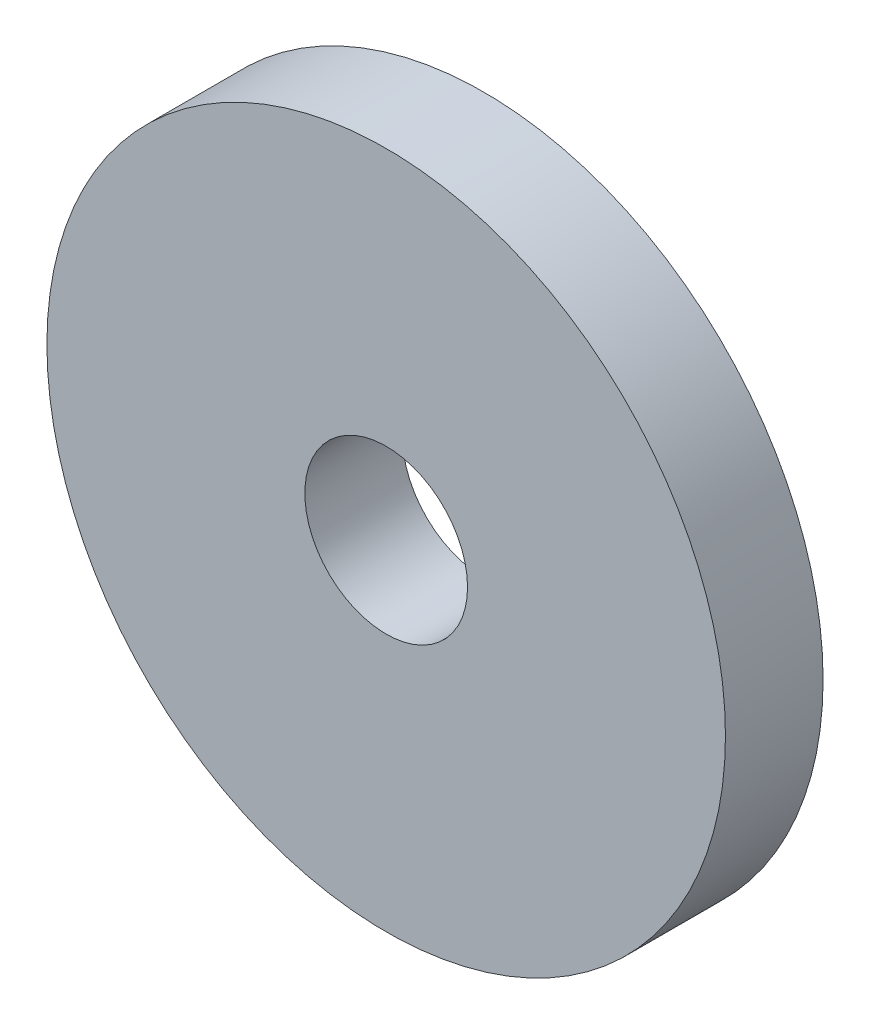
ISO-10303-21;
HEADER;
FILE_DESCRIPTION(('STEP AP214'),'2;1');
FILE_NAME('part.step','',(''),(''),'','','');
FILE_SCHEMA(('AUTOMOTIVE_DESIGN { 1 0 10303 214 1 1 1 1 }'));
ENDSEC;
DATA;
#1=APPLICATION_CONTEXT('core data for automotive mechanical design processes');
#2=APPLICATION_PROTOCOL_DEFINITION('international standard','automotive_design',2000,#1);
#3=PRODUCT_CONTEXT('',#1,'mechanical');
#4=PRODUCT('Part','Part','',(#3));
#5=PRODUCT_RELATED_PRODUCT_CATEGORY('part','',(#4));
#6=PRODUCT_DEFINITION_FORMATION('','',#4);
#7=PRODUCT_DEFINITION_CONTEXT('part definition',#1,'design');
#8=PRODUCT_DEFINITION('design','',#6,#7);
#9=PRODUCT_DEFINITION_SHAPE('','',#8);
#10=(LENGTH_UNIT() NAMED_UNIT(*) SI_UNIT(.MILLI.,.METRE.));
#11=(NAMED_UNIT(*) PLANE_ANGLE_UNIT() SI_UNIT($,.RADIAN.));
#12=(NAMED_UNIT(*) SI_UNIT($,.STERADIAN.) SOLID_ANGLE_UNIT());
#13=UNCERTAINTY_MEASURE_WITH_UNIT(LENGTH_MEASURE(1.E-05),#10,'distance_accuracy_value','');
#14=(GEOMETRIC_REPRESENTATION_CONTEXT(3) GLOBAL_UNCERTAINTY_ASSIGNED_CONTEXT((#13)) GLOBAL_UNIT_ASSIGNED_CONTEXT((#10,
#11,#12)) REPRESENTATION_CONTEXT('',''));
#15=CARTESIAN_POINT('',(0.,0.,0.));
#16=DIRECTION('',(0.,0.,1.));
#17=DIRECTION('',(1.,0.,0.));
#18=AXIS2_PLACEMENT_3D('',#15,#16,#17);
#19=CARTESIAN_POINT('',(0.,0.,30.));
#20=DIRECTION('',(0.,0.,1.));
#21=DIRECTION('',(1.,0.,0.));
#22=AXIS2_PLACEMENT_3D('',#19,#20,#21);
#23=PLANE('',#22);
#24=CARTESIAN_POINT('',(0.,0.,30.));
#25=DIRECTION('',(0.,0.,1.));
#26=DIRECTION('',(1.,0.,0.));
#27=AXIS2_PLACEMENT_3D('',#24,#25,#26);
#28=CIRCLE('',#27,104.25);
#29=CARTESIAN_POINT('',(104.25,0.,30.));
#30=VERTEX_POINT('',#29);
#31=EDGE_CURVE('E10',#30,#30,#28,.T.);
#32=ORIENTED_EDGE('',*,*,#31,.T.);
#33=EDGE_LOOP('',(#32));
#34=FACE_BOUND('',#33,.T.);
#35=CARTESIAN_POINT('',(0.,0.,30.));
#36=DIRECTION('',(0.,0.,1.));
#37=DIRECTION('',(1.,0.,0.));
#38=AXIS2_PLACEMENT_3D('',#35,#36,#37);
#39=CIRCLE('',#38,25.);
#40=CARTESIAN_POINT('',(25.,0.,30.));
#41=VERTEX_POINT('',#40);
#42=EDGE_CURVE('E50',#41,#41,#39,.T.);
#43=ORIENTED_EDGE('',*,*,#42,.F.);
#44=EDGE_LOOP('',(#43));
#45=FACE_BOUND('',#44,.T.);
#46=ADVANCED_FACE('F37',(#34,#45),#23,.T.);
#47=CARTESIAN_POINT('',(0.,0.,0.));
#48=DIRECTION('',(0.,0.,1.));
#49=DIRECTION('',(1.,0.,0.));
#50=AXIS2_PLACEMENT_3D('',#47,#48,#49);
#51=PLANE('',#50);
#52=CARTESIAN_POINT('',(0.,0.,0.));
#53=DIRECTION('',(0.,0.,1.));
#54=DIRECTION('',(1.,0.,0.));
#55=AXIS2_PLACEMENT_3D('',#52,#53,#54);
#56=CIRCLE('',#55,104.25);
#57=CARTESIAN_POINT('',(104.25,0.,0.));
#58=VERTEX_POINT('',#57);
#59=EDGE_CURVE('E41',#58,#58,#56,.T.);
#60=ORIENTED_EDGE('',*,*,#59,.F.);
#61=EDGE_LOOP('',(#60));
#62=FACE_BOUND('',#61,.T.);
#63=CARTESIAN_POINT('',(0.,0.,0.));
#64=DIRECTION('',(0.,0.,1.));
#65=DIRECTION('',(1.,0.,0.));
#66=AXIS2_PLACEMENT_3D('',#63,#64,#65);
#67=CIRCLE('',#66,25.);
#68=CARTESIAN_POINT('',(25.,0.,0.));
#69=VERTEX_POINT('',#68);
#70=EDGE_CURVE('E52',#69,#69,#67,.T.);
#71=ORIENTED_EDGE('',*,*,#70,.T.);
#72=EDGE_LOOP('',(#71));
#73=FACE_BOUND('',#72,.T.);
#74=ADVANCED_FACE('F64',(#62,#73),#51,.F.);
#75=CARTESIAN_POINT('',(0.,0.,30.));
#76=DIRECTION('',(0.,0.,-1.));
#77=DIRECTION('',(-1.,0.,0.));
#78=AXIS2_PLACEMENT_3D('',#75,#76,#77);
#79=CYLINDRICAL_SURFACE('',#78,104.25);
#80=ORIENTED_EDGE('',*,*,#31,.F.);
#81=EDGE_LOOP('',(#80));
#82=FACE_BOUND('',#81,.T.);
#83=ORIENTED_EDGE('',*,*,#59,.T.);
#84=EDGE_LOOP('',(#83));
#85=FACE_BOUND('',#84,.T.);
#86=ADVANCED_FACE('F39',(#82,#85),#79,.T.);
#87=CARTESIAN_POINT('',(0.,0.,30.));
#88=DIRECTION('',(0.,0.,-1.));
#89=DIRECTION('',(-1.,0.,0.));
#90=AXIS2_PLACEMENT_3D('',#87,#88,#89);
#91=CYLINDRICAL_SURFACE('',#90,25.);
#92=ORIENTED_EDGE('',*,*,#42,.T.);
#93=EDGE_LOOP('',(#92));
#94=FACE_BOUND('',#93,.T.);
#95=ORIENTED_EDGE('',*,*,#70,.F.);
#96=EDGE_LOOP('',(#95));
#97=FACE_BOUND('',#96,.T.);
#98=ADVANCED_FACE('F60',(#94,#97),#91,.F.);
#99=CLOSED_SHELL('',(#46,#74,#86,#98));
#100=MANIFOLD_SOLID_BREP('B2',#99);
#101=ADVANCED_BREP_SHAPE_REPRESENTATION('',(#18,#100),#14);
#102=SHAPE_DEFINITION_REPRESENTATION(#9,#101);
ENDSEC;
END-ISO-10303-21;
